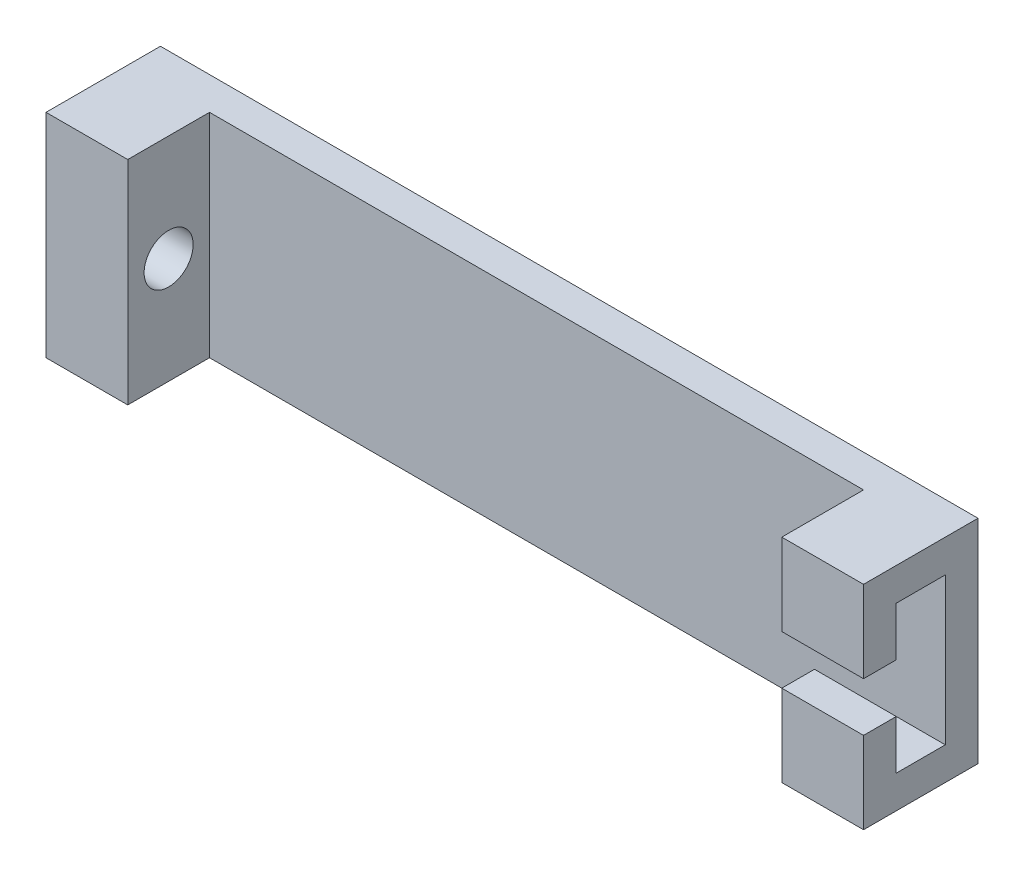
ISO-10303-21;
HEADER;
FILE_DESCRIPTION(('STEP AP214'),'2;1');
FILE_NAME('part.step','',(''),(''),'','','');
FILE_SCHEMA(('AUTOMOTIVE_DESIGN { 1 0 10303 214 1 1 1 1 }'));
ENDSEC;
DATA;
#1=APPLICATION_CONTEXT('core data for automotive mechanical design processes');
#2=APPLICATION_PROTOCOL_DEFINITION('international standard','automotive_design',2000,#1);
#3=PRODUCT_CONTEXT('',#1,'mechanical');
#4=PRODUCT('Part','Part','',(#3));
#5=PRODUCT_RELATED_PRODUCT_CATEGORY('part','',(#4));
#6=PRODUCT_DEFINITION_FORMATION('','',#4);
#7=PRODUCT_DEFINITION_CONTEXT('part definition',#1,'design');
#8=PRODUCT_DEFINITION('design','',#6,#7);
#9=PRODUCT_DEFINITION_SHAPE('','',#8);
#10=(LENGTH_UNIT() NAMED_UNIT(*) SI_UNIT(.MILLI.,.METRE.));
#11=(NAMED_UNIT(*) PLANE_ANGLE_UNIT() SI_UNIT($,.RADIAN.));
#12=(NAMED_UNIT(*) SI_UNIT($,.STERADIAN.) SOLID_ANGLE_UNIT());
#13=UNCERTAINTY_MEASURE_WITH_UNIT(LENGTH_MEASURE(1.E-05),#10,'distance_accuracy_value','');
#14=(GEOMETRIC_REPRESENTATION_CONTEXT(3) GLOBAL_UNCERTAINTY_ASSIGNED_CONTEXT((#13)) GLOBAL_UNIT_ASSIGNED_CONTEXT((#10,
#11,#12)) REPRESENTATION_CONTEXT('',''));
#15=CARTESIAN_POINT('',(0.,0.,0.));
#16=DIRECTION('',(0.,0.,1.));
#17=DIRECTION('',(1.,0.,0.));
#18=AXIS2_PLACEMENT_3D('',#15,#16,#17);
#19=CARTESIAN_POINT('',(20.,6.5,6.99999999999999));
#20=DIRECTION('',(1.,0.,0.));
#21=DIRECTION('',(0.,0.,-1.));
#22=AXIS2_PLACEMENT_3D('',#19,#20,#21);
#23=PLANE('',#22);
#24=DIRECTION('',(0.,1.,0.));
#25=VECTOR('',#24,1.);
#26=CARTESIAN_POINT('',(20.,4.5,5.));
#27=LINE('',#26,#25);
#28=CARTESIAN_POINT('',(20.,1.5,5.));
#29=VERTEX_POINT('',#28);
#30=CARTESIAN_POINT('',(20.,4.5,5.));
#31=VERTEX_POINT('',#30);
#32=EDGE_CURVE('E278',#29,#31,#27,.T.);
#33=ORIENTED_EDGE('',*,*,#32,.F.);
#34=DIRECTION('',(0.,0.,-1.));
#35=VECTOR('',#34,1.);
#36=CARTESIAN_POINT('',(20.,1.5,5.));
#37=LINE('',#36,#35);
#38=CARTESIAN_POINT('',(20.,1.5,6.99999999999999));
#39=VERTEX_POINT('',#38);
#40=EDGE_CURVE('E56',#39,#29,#37,.T.);
#41=ORIENTED_EDGE('',*,*,#40,.F.);
#42=DIRECTION('',(0.,-1.,0.));
#43=VECTOR('',#42,1.);
#44=CARTESIAN_POINT('',(20.,6.5,6.99999999999999));
#45=LINE('',#44,#43);
#46=CARTESIAN_POINT('',(20.,6.5,6.99999999999999));
#47=VERTEX_POINT('',#46);
#48=EDGE_CURVE('E178',#47,#39,#45,.T.);
#49=ORIENTED_EDGE('',*,*,#48,.F.);
#50=DIRECTION('',(0.,0.,-1.));
#51=VECTOR('',#50,1.);
#52=CARTESIAN_POINT('',(20.,6.5,6.99999999999999));
#53=LINE('',#52,#51);
#54=CARTESIAN_POINT('',(20.,6.5,2.));
#55=VERTEX_POINT('',#54);
#56=EDGE_CURVE('E188',#47,#55,#53,.T.);
#57=ORIENTED_EDGE('',*,*,#56,.T.);
#58=DIRECTION('',(0.,-1.,0.));
#59=VECTOR('',#58,1.);
#60=CARTESIAN_POINT('',(20.,6.5,2.));
#61=LINE('',#60,#59);
#62=CARTESIAN_POINT('',(20.,4.5,2.));
#63=VERTEX_POINT('',#62);
#64=EDGE_CURVE('E173',#55,#63,#61,.T.);
#65=ORIENTED_EDGE('',*,*,#64,.T.);
#66=DIRECTION('',(0.,0.,-1.));
#67=VECTOR('',#66,1.);
#68=CARTESIAN_POINT('',(20.,4.5,2.));
#69=LINE('',#68,#67);
#70=EDGE_CURVE('E269',#31,#63,#69,.T.);
#71=ORIENTED_EDGE('',*,*,#70,.F.);
#72=EDGE_LOOP('',(#33,#41,#49,#57,#65,#71));
#73=FACE_BOUND('',#72,.T.);
#74=ADVANCED_FACE('F33',(#73),#23,.F.);
#75=CARTESIAN_POINT('',(0.,0.,6.99999999999999));
#76=DIRECTION('',(0.,0.,-1.));
#77=DIRECTION('',(-1.,0.,0.));
#78=AXIS2_PLACEMENT_3D('',#75,#76,#77);
#79=PLANE('',#78);
#80=ORIENTED_EDGE('',*,*,#48,.T.);
#81=DIRECTION('',(-1.,0.,0.));
#82=VECTOR('',#81,1.);
#83=CARTESIAN_POINT('',(25.,1.5,6.99999999999999));
#84=LINE('',#83,#82);
#85=CARTESIAN_POINT('',(25.,1.5,6.99999999999999));
#86=VERTEX_POINT('',#85);
#87=EDGE_CURVE('E151',#86,#39,#84,.T.);
#88=ORIENTED_EDGE('',*,*,#87,.F.);
#89=DIRECTION('',(0.,1.,0.));
#90=VECTOR('',#89,1.);
#91=CARTESIAN_POINT('',(25.,6.5,6.99999999999999));
#92=LINE('',#91,#90);
#93=CARTESIAN_POINT('',(25.,6.5,6.99999999999999));
#94=VERTEX_POINT('',#93);
#95=EDGE_CURVE('E169',#86,#94,#92,.T.);
#96=ORIENTED_EDGE('',*,*,#95,.T.);
#97=DIRECTION('',(-1.,0.,0.));
#98=VECTOR('',#97,1.);
#99=CARTESIAN_POINT('',(25.,6.5,6.99999999999999));
#100=LINE('',#99,#98);
#101=EDGE_CURVE('E168',#94,#47,#100,.T.);
#102=ORIENTED_EDGE('',*,*,#101,.T.);
#103=EDGE_LOOP('',(#80,#88,#96,#102));
#104=FACE_BOUND('',#103,.T.);
#105=ADVANCED_FACE('F256',(#104),#79,.F.);
#106=CARTESIAN_POINT('',(25.,4.5,5.));
#107=DIRECTION('',(0.,0.,1.));
#108=DIRECTION('',(0.,-1.,0.));
#109=AXIS2_PLACEMENT_3D('',#106,#107,#108);
#110=PLANE('',#109);
#111=DIRECTION('',(0.,1.,0.));
#112=VECTOR('',#111,1.);
#113=CARTESIAN_POINT('',(25.,4.5,5.));
#114=LINE('',#113,#112);
#115=CARTESIAN_POINT('',(25.,1.5,5.));
#116=VERTEX_POINT('',#115);
#117=CARTESIAN_POINT('',(25.,4.5,5.));
#118=VERTEX_POINT('',#117);
#119=EDGE_CURVE('E271',#116,#118,#114,.T.);
#120=ORIENTED_EDGE('',*,*,#119,.F.);
#121=DIRECTION('',(-1.,0.,0.));
#122=VECTOR('',#121,1.);
#123=CARTESIAN_POINT('',(25.,1.5,5.));
#124=LINE('',#123,#122);
#125=EDGE_CURVE('E258',#116,#29,#124,.T.);
#126=ORIENTED_EDGE('',*,*,#125,.T.);
#127=ORIENTED_EDGE('',*,*,#32,.T.);
#128=DIRECTION('',(-1.,0.,0.));
#129=VECTOR('',#128,1.);
#130=CARTESIAN_POINT('',(25.,4.5,5.));
#131=LINE('',#130,#129);
#132=EDGE_CURVE('E286',#118,#31,#131,.T.);
#133=ORIENTED_EDGE('',*,*,#132,.F.);
#134=EDGE_LOOP('',(#120,#126,#127,#133));
#135=FACE_BOUND('',#134,.T.);
#136=ADVANCED_FACE('F317',(#135),#110,.F.);
#137=CARTESIAN_POINT('',(0.,0.,2.));
#138=DIRECTION('',(0.,0.,1.));
#139=DIRECTION('',(1.,0.,0.));
#140=AXIS2_PLACEMENT_3D('',#137,#138,#139);
#141=PLANE('',#140);
#142=DIRECTION('',(1.,0.,0.));
#143=VECTOR('',#142,1.);
#144=CARTESIAN_POINT('',(-25.,-6.5,2.));
#145=LINE('',#144,#143);
#146=CARTESIAN_POINT('',(-20.,-6.5,2.));
#147=VERTEX_POINT('',#146);
#148=CARTESIAN_POINT('',(20.,-6.5,2.));
#149=VERTEX_POINT('',#148);
#150=EDGE_CURVE('E219',#147,#149,#145,.T.);
#151=ORIENTED_EDGE('',*,*,#150,.T.);
#152=CARTESIAN_POINT('',(20.,-4.5,2.));
#153=VERTEX_POINT('',#152);
#154=EDGE_CURVE('E185',#153,#149,#61,.T.);
#155=ORIENTED_EDGE('',*,*,#154,.F.);
#156=DIRECTION('',(-1.,0.,0.));
#157=VECTOR('',#156,1.);
#158=CARTESIAN_POINT('',(25.,-4.5,2.));
#159=LINE('',#158,#157);
#160=CARTESIAN_POINT('',(25.,-4.5,2.));
#161=VERTEX_POINT('',#160);
#162=EDGE_CURVE('E175',#161,#153,#159,.T.);
#163=ORIENTED_EDGE('',*,*,#162,.F.);
#164=DIRECTION('',(0.,-1.,0.));
#165=VECTOR('',#164,1.);
#166=CARTESIAN_POINT('',(25.,4.5,2.));
#167=LINE('',#166,#165);
#168=CARTESIAN_POINT('',(25.,4.5,2.));
#169=VERTEX_POINT('',#168);
#170=EDGE_CURVE('E265',#169,#161,#167,.T.);
#171=ORIENTED_EDGE('',*,*,#170,.F.);
#172=DIRECTION('',(-1.,0.,0.));
#173=VECTOR('',#172,1.);
#174=CARTESIAN_POINT('',(25.,4.5,2.));
#175=LINE('',#174,#173);
#176=EDGE_CURVE('E284',#169,#63,#175,.T.);
#177=ORIENTED_EDGE('',*,*,#176,.T.);
#178=ORIENTED_EDGE('',*,*,#64,.F.);
#179=DIRECTION('',(-1.,0.,0.));
#180=VECTOR('',#179,1.);
#181=CARTESIAN_POINT('',(-25.,6.5,2.));
#182=LINE('',#181,#180);
#183=CARTESIAN_POINT('',(-20.,6.5,2.));
#184=VERTEX_POINT('',#183);
#185=EDGE_CURVE('E217',#55,#184,#182,.T.);
#186=ORIENTED_EDGE('',*,*,#185,.T.);
#187=DIRECTION('',(0.,1.,0.));
#188=VECTOR('',#187,1.);
#189=CARTESIAN_POINT('',(-20.,6.5,2.));
#190=LINE('',#189,#188);
#191=EDGE_CURVE('E195',#147,#184,#190,.T.);
#192=ORIENTED_EDGE('',*,*,#191,.F.);
#193=EDGE_LOOP('',(#151,#155,#163,#171,#177,#178,#186,#192));
#194=FACE_BOUND('',#193,.T.);
#195=ADVANCED_FACE('F302',(#194),#141,.T.);
#196=CARTESIAN_POINT('',(25.,6.5,2.));
#197=DIRECTION('',(-1.,0.,0.));
#198=DIRECTION('',(0.,0.,1.));
#199=AXIS2_PLACEMENT_3D('',#196,#197,#198);
#200=PLANE('',#199);
#201=ORIENTED_EDGE('',*,*,#95,.F.);
#202=DIRECTION('',(0.,0.,-1.));
#203=VECTOR('',#202,1.);
#204=CARTESIAN_POINT('',(25.,1.5,5.));
#205=LINE('',#204,#203);
#206=EDGE_CURVE('E162',#86,#116,#205,.T.);
#207=ORIENTED_EDGE('',*,*,#206,.T.);
#208=ORIENTED_EDGE('',*,*,#119,.T.);
#209=DIRECTION('',(0.,0.,-1.));
#210=VECTOR('',#209,1.);
#211=CARTESIAN_POINT('',(25.,4.5,2.));
#212=LINE('',#211,#210);
#213=EDGE_CURVE('E273',#118,#169,#212,.T.);
#214=ORIENTED_EDGE('',*,*,#213,.T.);
#215=ORIENTED_EDGE('',*,*,#170,.T.);
#216=DIRECTION('',(0.,0.,1.));
#217=VECTOR('',#216,1.);
#218=CARTESIAN_POINT('',(25.,-4.5,2.));
#219=LINE('',#218,#217);
#220=CARTESIAN_POINT('',(25.,-4.5,5.));
#221=VERTEX_POINT('',#220);
#222=EDGE_CURVE('E268',#161,#221,#219,.T.);
#223=ORIENTED_EDGE('',*,*,#222,.T.);
#224=CARTESIAN_POINT('',(25.,-1.5,5.));
#225=VERTEX_POINT('',#224);
#226=EDGE_CURVE('E161',#221,#225,#114,.T.);
#227=ORIENTED_EDGE('',*,*,#226,.T.);
#228=DIRECTION('',(0.,0.,1.));
#229=VECTOR('',#228,1.);
#230=CARTESIAN_POINT('',(25.,-1.5,5.));
#231=LINE('',#230,#229);
#232=CARTESIAN_POINT('',(25.,-1.5,6.99999999999999));
#233=VERTEX_POINT('',#232);
#234=EDGE_CURVE('E48',#225,#233,#231,.T.);
#235=ORIENTED_EDGE('',*,*,#234,.T.);
#236=CARTESIAN_POINT('',(25.,-6.5,6.99999999999999));
#237=VERTEX_POINT('',#236);
#238=EDGE_CURVE('E159',#237,#233,#92,.T.);
#239=ORIENTED_EDGE('',*,*,#238,.F.);
#240=DIRECTION('',(0.,0.,-1.));
#241=VECTOR('',#240,1.);
#242=CARTESIAN_POINT('',(25.,-6.5,2.));
#243=LINE('',#242,#241);
#244=CARTESIAN_POINT('',(25.,-6.5,0.));
#245=VERTEX_POINT('',#244);
#246=EDGE_CURVE('E223',#237,#245,#243,.T.);
#247=ORIENTED_EDGE('',*,*,#246,.T.);
#248=DIRECTION('',(0.,1.,0.));
#249=VECTOR('',#248,1.);
#250=CARTESIAN_POINT('',(25.,6.5,0.));
#251=LINE('',#250,#249);
#252=CARTESIAN_POINT('',(25.,6.5,0.));
#253=VERTEX_POINT('',#252);
#254=EDGE_CURVE('E216',#245,#253,#251,.T.);
#255=ORIENTED_EDGE('',*,*,#254,.T.);
#256=DIRECTION('',(0.,0.,-1.));
#257=VECTOR('',#256,1.);
#258=CARTESIAN_POINT('',(25.,6.5,2.));
#259=LINE('',#258,#257);
#260=EDGE_CURVE('E11',#94,#253,#259,.T.);
#261=ORIENTED_EDGE('',*,*,#260,.F.);
#262=EDGE_LOOP('',(#201,#207,#208,#214,#215,#223,#227,#235,#239,#247,#255,#261));
#263=FACE_BOUND('',#262,.T.);
#264=ADVANCED_FACE('F35',(#263),#200,.F.);
#265=CARTESIAN_POINT('',(-25.,6.5,2.));
#266=DIRECTION('',(0.,-1.,0.));
#267=DIRECTION('',(0.,0.,-1.));
#268=AXIS2_PLACEMENT_3D('',#265,#266,#267);
#269=PLANE('',#268);
#270=DIRECTION('',(-1.,0.,0.));
#271=VECTOR('',#270,1.);
#272=CARTESIAN_POINT('',(-25.,6.5,0.));
#273=LINE('',#272,#271);
#274=CARTESIAN_POINT('',(-25.,6.5,0.));
#275=VERTEX_POINT('',#274);
#276=EDGE_CURVE('E226',#253,#275,#273,.T.);
#277=ORIENTED_EDGE('',*,*,#276,.T.);
#278=DIRECTION('',(0.,0.,-1.));
#279=VECTOR('',#278,1.);
#280=CARTESIAN_POINT('',(-25.,6.5,2.));
#281=LINE('',#280,#279);
#282=CARTESIAN_POINT('',(-25.,6.5,6.99999999999999));
#283=VERTEX_POINT('',#282);
#284=EDGE_CURVE('E41',#283,#275,#281,.T.);
#285=ORIENTED_EDGE('',*,*,#284,.F.);
#286=DIRECTION('',(-1.,0.,0.));
#287=VECTOR('',#286,1.);
#288=CARTESIAN_POINT('',(-25.,6.5,6.99999999999999));
#289=LINE('',#288,#287);
#290=CARTESIAN_POINT('',(-20.,6.5,6.99999999999999));
#291=VERTEX_POINT('',#290);
#292=EDGE_CURVE('E205',#291,#283,#289,.T.);
#293=ORIENTED_EDGE('',*,*,#292,.F.);
#294=DIRECTION('',(0.,0.,-1.));
#295=VECTOR('',#294,1.);
#296=CARTESIAN_POINT('',(-20.,6.5,6.99999999999999));
#297=LINE('',#296,#295);
#298=EDGE_CURVE('E208',#291,#184,#297,.T.);
#299=ORIENTED_EDGE('',*,*,#298,.T.);
#300=ORIENTED_EDGE('',*,*,#185,.F.);
#301=ORIENTED_EDGE('',*,*,#56,.F.);
#302=ORIENTED_EDGE('',*,*,#101,.F.);
#303=ORIENTED_EDGE('',*,*,#260,.T.);
#304=EDGE_LOOP('',(#277,#285,#293,#299,#300,#301,#302,#303));
#305=FACE_BOUND('',#304,.T.);
#306=ADVANCED_FACE('F252',(#305),#269,.F.);
#307=CARTESIAN_POINT('',(-25.,6.5,2.));
#308=DIRECTION('',(1.,0.,0.));
#309=DIRECTION('',(0.,0.,-1.));
#310=AXIS2_PLACEMENT_3D('',#307,#308,#309);
#311=PLANE('',#310);
#312=CARTESIAN_POINT('',(-25.,0.,4.49999999999999));
#313=DIRECTION('',(1.,0.,0.));
#314=DIRECTION('',(0.,0.,-1.));
#315=AXIS2_PLACEMENT_3D('',#312,#313,#314);
#316=CIRCLE('',#315,1.5);
#317=CARTESIAN_POINT('',(-25.,0.,2.99999999999999));
#318=VERTEX_POINT('',#317);
#319=EDGE_CURVE('E192',#318,#318,#316,.T.);
#320=ORIENTED_EDGE('',*,*,#319,.T.);
#321=EDGE_LOOP('',(#320));
#322=FACE_BOUND('',#321,.T.);
#323=DIRECTION('',(0.,-1.,0.));
#324=VECTOR('',#323,1.);
#325=CARTESIAN_POINT('',(-25.,6.5,0.));
#326=LINE('',#325,#324);
#327=CARTESIAN_POINT('',(-25.,-6.5,0.));
#328=VERTEX_POINT('',#327);
#329=EDGE_CURVE('E228',#275,#328,#326,.T.);
#330=ORIENTED_EDGE('',*,*,#329,.T.);
#331=DIRECTION('',(0.,0.,-1.));
#332=VECTOR('',#331,1.);
#333=CARTESIAN_POINT('',(-25.,-6.5,2.));
#334=LINE('',#333,#332);
#335=CARTESIAN_POINT('',(-25.,-6.5,6.99999999999999));
#336=VERTEX_POINT('',#335);
#337=EDGE_CURVE('E232',#336,#328,#334,.T.);
#338=ORIENTED_EDGE('',*,*,#337,.F.);
#339=DIRECTION('',(0.,-1.,0.));
#340=VECTOR('',#339,1.);
#341=CARTESIAN_POINT('',(-25.,6.5,6.99999999999999));
#342=LINE('',#341,#340);
#343=EDGE_CURVE('E198',#283,#336,#342,.T.);
#344=ORIENTED_EDGE('',*,*,#343,.F.);
#345=ORIENTED_EDGE('',*,*,#284,.T.);
#346=EDGE_LOOP('',(#330,#338,#344,#345));
#347=FACE_BOUND('',#346,.T.);
#348=ADVANCED_FACE('F238',(#322,#347),#311,.F.);
#349=CARTESIAN_POINT('',(-25.,-6.5,2.));
#350=DIRECTION('',(0.,1.,0.));
#351=DIRECTION('',(0.,0.,1.));
#352=AXIS2_PLACEMENT_3D('',#349,#350,#351);
#353=PLANE('',#352);
#354=DIRECTION('',(1.,0.,0.));
#355=VECTOR('',#354,1.);
#356=CARTESIAN_POINT('',(-25.,-6.5,0.));
#357=LINE('',#356,#355);
#358=EDGE_CURVE('E220',#328,#245,#357,.T.);
#359=ORIENTED_EDGE('',*,*,#358,.T.);
#360=ORIENTED_EDGE('',*,*,#246,.F.);
#361=DIRECTION('',(1.,0.,0.));
#362=VECTOR('',#361,1.);
#363=CARTESIAN_POINT('',(25.,-6.5,6.99999999999999));
#364=LINE('',#363,#362);
#365=CARTESIAN_POINT('',(20.,-6.5,6.99999999999999));
#366=VERTEX_POINT('',#365);
#367=EDGE_CURVE('E167',#366,#237,#364,.T.);
#368=ORIENTED_EDGE('',*,*,#367,.F.);
#369=DIRECTION('',(0.,0.,-1.));
#370=VECTOR('',#369,1.);
#371=CARTESIAN_POINT('',(20.,-6.5,6.99999999999999));
#372=LINE('',#371,#370);
#373=EDGE_CURVE('E182',#366,#149,#372,.T.);
#374=ORIENTED_EDGE('',*,*,#373,.T.);
#375=ORIENTED_EDGE('',*,*,#150,.F.);
#376=DIRECTION('',(0.,0.,-1.));
#377=VECTOR('',#376,1.);
#378=CARTESIAN_POINT('',(-20.,-6.5,6.99999999999999));
#379=LINE('',#378,#377);
#380=CARTESIAN_POINT('',(-20.,-6.5,6.99999999999999));
#381=VERTEX_POINT('',#380);
#382=EDGE_CURVE('E213',#381,#147,#379,.T.);
#383=ORIENTED_EDGE('',*,*,#382,.F.);
#384=DIRECTION('',(1.,0.,0.));
#385=VECTOR('',#384,1.);
#386=CARTESIAN_POINT('',(-25.,-6.5,6.99999999999999));
#387=LINE('',#386,#385);
#388=EDGE_CURVE('E201',#336,#381,#387,.T.);
#389=ORIENTED_EDGE('',*,*,#388,.F.);
#390=ORIENTED_EDGE('',*,*,#337,.T.);
#391=EDGE_LOOP('',(#359,#360,#368,#374,#375,#383,#389,#390));
#392=FACE_BOUND('',#391,.T.);
#393=ADVANCED_FACE('F246',(#392),#353,.F.);
#394=CARTESIAN_POINT('',(0.,0.,0.));
#395=DIRECTION('',(0.,0.,1.));
#396=DIRECTION('',(1.,0.,0.));
#397=AXIS2_PLACEMENT_3D('',#394,#395,#396);
#398=PLANE('',#397);
#399=ORIENTED_EDGE('',*,*,#254,.F.);
#400=ORIENTED_EDGE('',*,*,#358,.F.);
#401=ORIENTED_EDGE('',*,*,#329,.F.);
#402=ORIENTED_EDGE('',*,*,#276,.F.);
#403=EDGE_LOOP('',(#399,#400,#401,#402));
#404=FACE_BOUND('',#403,.T.);
#405=ADVANCED_FACE('F244',(#404),#398,.F.);
#406=CARTESIAN_POINT('',(-20.,6.5,6.99999999999999));
#407=DIRECTION('',(-1.,0.,0.));
#408=DIRECTION('',(0.,0.,1.));
#409=AXIS2_PLACEMENT_3D('',#406,#407,#408);
#410=PLANE('',#409);
#411=CARTESIAN_POINT('',(-20.,0.,4.49999999999999));
#412=DIRECTION('',(1.,0.,0.));
#413=DIRECTION('',(0.,0.,-1.));
#414=AXIS2_PLACEMENT_3D('',#411,#412,#413);
#415=CIRCLE('',#414,1.5);
#416=CARTESIAN_POINT('',(-20.,0.,2.99999999999999));
#417=VERTEX_POINT('',#416);
#418=EDGE_CURVE('E191',#417,#417,#415,.T.);
#419=ORIENTED_EDGE('',*,*,#418,.F.);
#420=EDGE_LOOP('',(#419));
#421=FACE_BOUND('',#420,.T.);
#422=ORIENTED_EDGE('',*,*,#191,.T.);
#423=ORIENTED_EDGE('',*,*,#298,.F.);
#424=DIRECTION('',(0.,1.,0.));
#425=VECTOR('',#424,1.);
#426=CARTESIAN_POINT('',(-20.,6.5,6.99999999999999));
#427=LINE('',#426,#425);
#428=EDGE_CURVE('E203',#381,#291,#427,.T.);
#429=ORIENTED_EDGE('',*,*,#428,.F.);
#430=ORIENTED_EDGE('',*,*,#382,.T.);
#431=EDGE_LOOP('',(#422,#423,#429,#430));
#432=FACE_BOUND('',#431,.T.);
#433=ADVANCED_FACE('F343',(#421,#432),#410,.F.);
#434=CARTESIAN_POINT('',(0.,0.,6.99999999999999));
#435=DIRECTION('',(0.,0.,1.));
#436=DIRECTION('',(1.,0.,0.));
#437=AXIS2_PLACEMENT_3D('',#434,#435,#436);
#438=PLANE('',#437);
#439=ORIENTED_EDGE('',*,*,#343,.T.);
#440=ORIENTED_EDGE('',*,*,#388,.T.);
#441=ORIENTED_EDGE('',*,*,#428,.T.);
#442=ORIENTED_EDGE('',*,*,#292,.T.);
#443=EDGE_LOOP('',(#439,#440,#441,#442));
#444=FACE_BOUND('',#443,.T.);
#445=ADVANCED_FACE('F338',(#444),#438,.T.);
#446=CARTESIAN_POINT('',(-25.,0.,4.49999999999999));
#447=DIRECTION('',(1.,0.,0.));
#448=DIRECTION('',(0.,0.,-1.));
#449=AXIS2_PLACEMENT_3D('',#446,#447,#448);
#450=CYLINDRICAL_SURFACE('',#449,1.5);
#451=ORIENTED_EDGE('',*,*,#319,.F.);
#452=EDGE_LOOP('',(#451));
#453=FACE_BOUND('',#452,.T.);
#454=ORIENTED_EDGE('',*,*,#418,.T.);
#455=EDGE_LOOP('',(#454));
#456=FACE_BOUND('',#455,.T.);
#457=ADVANCED_FACE('F333',(#453,#456),#450,.F.);
#458=CARTESIAN_POINT('',(20.,-1.5,6.99999999999999));
#459=VERTEX_POINT('',#458);
#460=EDGE_CURVE('E171',#459,#366,#45,.T.);
#461=ORIENTED_EDGE('',*,*,#460,.F.);
#462=DIRECTION('',(0.,0.,1.));
#463=VECTOR('',#462,1.);
#464=CARTESIAN_POINT('',(20.,-1.5,5.));
#465=LINE('',#464,#463);
#466=CARTESIAN_POINT('',(20.,-1.5,5.));
#467=VERTEX_POINT('',#466);
#468=EDGE_CURVE('E147',#467,#459,#465,.T.);
#469=ORIENTED_EDGE('',*,*,#468,.F.);
#470=CARTESIAN_POINT('',(20.,-4.5,5.));
#471=VERTEX_POINT('',#470);
#472=EDGE_CURVE('E279',#471,#467,#27,.T.);
#473=ORIENTED_EDGE('',*,*,#472,.F.);
#474=DIRECTION('',(0.,0.,1.));
#475=VECTOR('',#474,1.);
#476=CARTESIAN_POINT('',(20.,-4.5,2.));
#477=LINE('',#476,#475);
#478=EDGE_CURVE('E260',#153,#471,#477,.T.);
#479=ORIENTED_EDGE('',*,*,#478,.F.);
#480=ORIENTED_EDGE('',*,*,#154,.T.);
#481=ORIENTED_EDGE('',*,*,#373,.F.);
#482=EDGE_LOOP('',(#461,#469,#473,#479,#480,#481));
#483=FACE_BOUND('',#482,.T.);
#484=ADVANCED_FACE('F300',(#483),#23,.F.);
#485=ORIENTED_EDGE('',*,*,#238,.T.);
#486=DIRECTION('',(-1.,0.,0.));
#487=VECTOR('',#486,1.);
#488=CARTESIAN_POINT('',(25.,-1.5,6.99999999999999));
#489=LINE('',#488,#487);
#490=EDGE_CURVE('E144',#233,#459,#489,.T.);
#491=ORIENTED_EDGE('',*,*,#490,.T.);
#492=ORIENTED_EDGE('',*,*,#460,.T.);
#493=ORIENTED_EDGE('',*,*,#367,.T.);
#494=EDGE_LOOP('',(#485,#491,#492,#493));
#495=FACE_BOUND('',#494,.T.);
#496=ADVANCED_FACE('F165',(#495),#79,.F.);
#497=CARTESIAN_POINT('',(25.,4.5,2.));
#498=DIRECTION('',(0.,1.,0.));
#499=DIRECTION('',(0.,0.,1.));
#500=AXIS2_PLACEMENT_3D('',#497,#498,#499);
#501=PLANE('',#500);
#502=ORIENTED_EDGE('',*,*,#70,.T.);
#503=ORIENTED_EDGE('',*,*,#176,.F.);
#504=ORIENTED_EDGE('',*,*,#213,.F.);
#505=ORIENTED_EDGE('',*,*,#132,.T.);
#506=EDGE_LOOP('',(#502,#503,#504,#505));
#507=FACE_BOUND('',#506,.T.);
#508=ADVANCED_FACE('F310',(#507),#501,.F.);
#509=ORIENTED_EDGE('',*,*,#472,.T.);
#510=DIRECTION('',(-1.,0.,0.));
#511=VECTOR('',#510,1.);
#512=CARTESIAN_POINT('',(25.,-1.5,5.));
#513=LINE('',#512,#511);
#514=EDGE_CURVE('E152',#225,#467,#513,.T.);
#515=ORIENTED_EDGE('',*,*,#514,.F.);
#516=ORIENTED_EDGE('',*,*,#226,.F.);
#517=DIRECTION('',(-1.,0.,0.));
#518=VECTOR('',#517,1.);
#519=CARTESIAN_POINT('',(25.,-4.5,5.));
#520=LINE('',#519,#518);
#521=EDGE_CURVE('E288',#221,#471,#520,.T.);
#522=ORIENTED_EDGE('',*,*,#521,.T.);
#523=EDGE_LOOP('',(#509,#515,#516,#522));
#524=FACE_BOUND('',#523,.T.);
#525=ADVANCED_FACE('F306',(#524),#110,.F.);
#526=CARTESIAN_POINT('',(25.,-4.5,2.));
#527=DIRECTION('',(0.,-1.,0.));
#528=DIRECTION('',(0.,0.,-1.));
#529=AXIS2_PLACEMENT_3D('',#526,#527,#528);
#530=PLANE('',#529);
#531=ORIENTED_EDGE('',*,*,#478,.T.);
#532=ORIENTED_EDGE('',*,*,#521,.F.);
#533=ORIENTED_EDGE('',*,*,#222,.F.);
#534=ORIENTED_EDGE('',*,*,#162,.T.);
#535=EDGE_LOOP('',(#531,#532,#533,#534));
#536=FACE_BOUND('',#535,.T.);
#537=ADVANCED_FACE('F294',(#536),#530,.F.);
#538=CARTESIAN_POINT('',(25.,-1.5,5.));
#539=DIRECTION('',(0.,-1.,0.));
#540=DIRECTION('',(0.,0.,-1.));
#541=AXIS2_PLACEMENT_3D('',#538,#539,#540);
#542=PLANE('',#541);
#543=ORIENTED_EDGE('',*,*,#468,.T.);
#544=ORIENTED_EDGE('',*,*,#490,.F.);
#545=ORIENTED_EDGE('',*,*,#234,.F.);
#546=ORIENTED_EDGE('',*,*,#514,.T.);
#547=EDGE_LOOP('',(#543,#544,#545,#546));
#548=FACE_BOUND('',#547,.T.);
#549=ADVANCED_FACE('F145',(#548),#542,.F.);
#550=CARTESIAN_POINT('',(25.,1.5,5.));
#551=DIRECTION('',(0.,1.,0.));
#552=DIRECTION('',(0.,0.,1.));
#553=AXIS2_PLACEMENT_3D('',#550,#551,#552);
#554=PLANE('',#553);
#555=ORIENTED_EDGE('',*,*,#40,.T.);
#556=ORIENTED_EDGE('',*,*,#125,.F.);
#557=ORIENTED_EDGE('',*,*,#206,.F.);
#558=ORIENTED_EDGE('',*,*,#87,.T.);
#559=EDGE_LOOP('',(#555,#556,#557,#558));
#560=FACE_BOUND('',#559,.T.);
#561=ADVANCED_FACE('F318',(#560),#554,.F.);
#562=CLOSED_SHELL('',(#74,#105,#136,#195,#264,#306,#348,#393,#405,#433,#445,#457,#484,#496,#508,
#525,#537,#549,#561));
#563=MANIFOLD_SOLID_BREP('B2',#562);
#564=ADVANCED_BREP_SHAPE_REPRESENTATION('',(#18,#563),#14);
#565=SHAPE_DEFINITION_REPRESENTATION(#9,#564);
ENDSEC;
END-ISO-10303-21;
